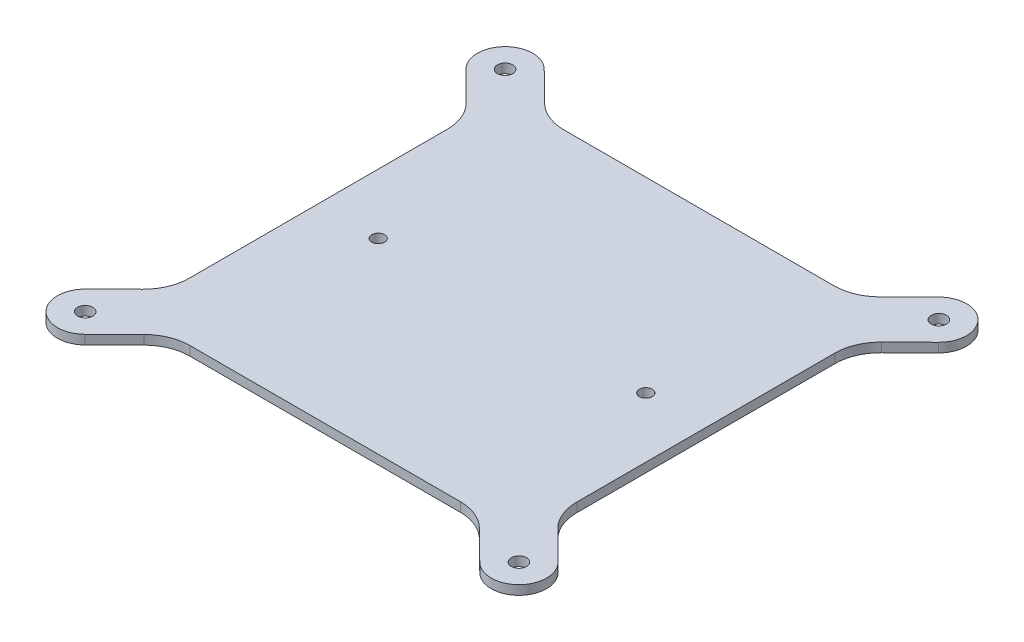
ISO-10303-21;
HEADER;
FILE_DESCRIPTION(('STEP AP214'),'2;1');
FILE_NAME('part.step','',(''),(''),'','','');
FILE_SCHEMA(('AUTOMOTIVE_DESIGN { 1 0 10303 214 1 1 1 1 }'));
ENDSEC;
DATA;
#1=APPLICATION_CONTEXT('core data for automotive mechanical design processes');
#2=APPLICATION_PROTOCOL_DEFINITION('international standard','automotive_design',2000,#1);
#3=PRODUCT_CONTEXT('',#1,'mechanical');
#4=PRODUCT('Part','Part','',(#3));
#5=PRODUCT_RELATED_PRODUCT_CATEGORY('part','',(#4));
#6=PRODUCT_DEFINITION_FORMATION('','',#4);
#7=PRODUCT_DEFINITION_CONTEXT('part definition',#1,'design');
#8=PRODUCT_DEFINITION('design','',#6,#7);
#9=PRODUCT_DEFINITION_SHAPE('','',#8);
#10=(LENGTH_UNIT() NAMED_UNIT(*) SI_UNIT(.MILLI.,.METRE.));
#11=(NAMED_UNIT(*) PLANE_ANGLE_UNIT() SI_UNIT($,.RADIAN.));
#12=(NAMED_UNIT(*) SI_UNIT($,.STERADIAN.) SOLID_ANGLE_UNIT());
#13=UNCERTAINTY_MEASURE_WITH_UNIT(LENGTH_MEASURE(1.E-05),#10,'distance_accuracy_value','');
#14=(GEOMETRIC_REPRESENTATION_CONTEXT(3) GLOBAL_UNCERTAINTY_ASSIGNED_CONTEXT((#13)) GLOBAL_UNIT_ASSIGNED_CONTEXT((#10,
#11,#12)) REPRESENTATION_CONTEXT('',''));
#15=CARTESIAN_POINT('',(0.,0.,0.));
#16=DIRECTION('',(0.,0.,1.));
#17=DIRECTION('',(1.,0.,0.));
#18=AXIS2_PLACEMENT_3D('',#15,#16,#17);
#19=CARTESIAN_POINT('',(42.,2.,40.5));
#20=DIRECTION('',(-1.,0.,0.));
#21=DIRECTION('',(0.,0.,1.));
#22=AXIS2_PLACEMENT_3D('',#19,#20,#21);
#23=PLANE('',#22);
#24=DIRECTION('',(0.,0.,-1.));
#25=VECTOR('',#24,1.);
#26=CARTESIAN_POINT('',(42.,2.,40.5));
#27=LINE('',#26,#25);
#28=CARTESIAN_POINT('',(42.,2.,27.9432522277284));
#29=VERTEX_POINT('',#28);
#30=CARTESIAN_POINT('',(42.,2.,-27.9432522277284));
#31=VERTEX_POINT('',#30);
#32=EDGE_CURVE('E310',#29,#31,#27,.T.);
#33=ORIENTED_EDGE('',*,*,#32,.F.);
#34=DIRECTION('',(0.,-1.,0.));
#35=VECTOR('',#34,1.);
#36=CARTESIAN_POINT('',(42.,2.,27.9432522277284));
#37=LINE('',#36,#35);
#38=CARTESIAN_POINT('',(42.,0.,27.9432522277284));
#39=VERTEX_POINT('',#38);
#40=EDGE_CURVE('E352',#29,#39,#37,.T.);
#41=ORIENTED_EDGE('',*,*,#40,.T.);
#42=DIRECTION('',(0.,0.,-1.));
#43=VECTOR('',#42,1.);
#44=CARTESIAN_POINT('',(42.,0.,40.5));
#45=LINE('',#44,#43);
#46=CARTESIAN_POINT('',(42.,0.,-27.9432522277284));
#47=VERTEX_POINT('',#46);
#48=EDGE_CURVE('E309',#39,#47,#45,.T.);
#49=ORIENTED_EDGE('',*,*,#48,.T.);
#50=DIRECTION('',(0.,-1.,0.));
#51=VECTOR('',#50,1.);
#52=CARTESIAN_POINT('',(42.,2.,-27.9432522277284));
#53=LINE('',#52,#51);
#54=EDGE_CURVE('E350',#47,#31,#53,.F.);
#55=ORIENTED_EDGE('',*,*,#54,.T.);
#56=EDGE_LOOP('',(#33,#41,#49,#55));
#57=FACE_BOUND('',#56,.T.);
#58=ADVANCED_FACE('F32',(#57),#23,.F.);
#59=CARTESIAN_POINT('',(42.,2.,-40.5));
#60=DIRECTION('',(0.,0.,1.));
#61=DIRECTION('',(1.,0.,0.));
#62=AXIS2_PLACEMENT_3D('',#59,#60,#61);
#63=PLANE('',#62);
#64=DIRECTION('',(-1.,0.,0.));
#65=VECTOR('',#64,1.);
#66=CARTESIAN_POINT('',(42.,2.,-40.5));
#67=LINE('',#66,#65);
#68=CARTESIAN_POINT('',(29.3003815198264,2.,-40.5));
#69=VERTEX_POINT('',#68);
#70=CARTESIAN_POINT('',(-29.3003815198264,2.,-40.5));
#71=VERTEX_POINT('',#70);
#72=EDGE_CURVE('E313',#69,#71,#67,.T.);
#73=ORIENTED_EDGE('',*,*,#72,.F.);
#74=DIRECTION('',(0.,1.,0.));
#75=VECTOR('',#74,1.);
#76=CARTESIAN_POINT('',(29.3003815198264,0.,-40.5));
#77=LINE('',#76,#75);
#78=CARTESIAN_POINT('',(29.3003815198264,0.,-40.5));
#79=VERTEX_POINT('',#78);
#80=EDGE_CURVE('E365',#69,#79,#77,.F.);
#81=ORIENTED_EDGE('',*,*,#80,.T.);
#82=DIRECTION('',(-1.,0.,0.));
#83=VECTOR('',#82,1.);
#84=CARTESIAN_POINT('',(42.,0.,-40.5));
#85=LINE('',#84,#83);
#86=CARTESIAN_POINT('',(-29.3003815198264,0.,-40.5));
#87=VERTEX_POINT('',#86);
#88=EDGE_CURVE('E325',#79,#87,#85,.T.);
#89=ORIENTED_EDGE('',*,*,#88,.T.);
#90=DIRECTION('',(0.,1.,0.));
#91=VECTOR('',#90,1.);
#92=CARTESIAN_POINT('',(-29.3003815198264,2.,-40.5));
#93=LINE('',#92,#91);
#94=EDGE_CURVE('E362',#87,#71,#93,.T.);
#95=ORIENTED_EDGE('',*,*,#94,.T.);
#96=EDGE_LOOP('',(#73,#81,#89,#95));
#97=FACE_BOUND('',#96,.T.);
#98=ADVANCED_FACE('F430',(#97),#63,.F.);
#99=CARTESIAN_POINT('',(-42.,2.,40.5));
#100=DIRECTION('',(1.,0.,0.));
#101=DIRECTION('',(0.,0.,-1.));
#102=AXIS2_PLACEMENT_3D('',#99,#100,#101);
#103=PLANE('',#102);
#104=DIRECTION('',(0.,0.,1.));
#105=VECTOR('',#104,1.);
#106=CARTESIAN_POINT('',(-42.,0.,40.5));
#107=LINE('',#106,#105);
#108=CARTESIAN_POINT('',(-42.,0.,-27.9432522277284));
#109=VERTEX_POINT('',#108);
#110=CARTESIAN_POINT('',(-42.,0.,27.9432522277284));
#111=VERTEX_POINT('',#110);
#112=EDGE_CURVE('E328',#109,#111,#107,.T.);
#113=ORIENTED_EDGE('',*,*,#112,.T.);
#114=DIRECTION('',(0.,-1.,0.));
#115=VECTOR('',#114,1.);
#116=CARTESIAN_POINT('',(-42.,2.,27.9432522277284));
#117=LINE('',#116,#115);
#118=CARTESIAN_POINT('',(-42.,2.,27.9432522277284));
#119=VERTEX_POINT('',#118);
#120=EDGE_CURVE('E338',#111,#119,#117,.F.);
#121=ORIENTED_EDGE('',*,*,#120,.T.);
#122=DIRECTION('',(0.,0.,1.));
#123=VECTOR('',#122,1.);
#124=CARTESIAN_POINT('',(-42.,2.,40.5));
#125=LINE('',#124,#123);
#126=CARTESIAN_POINT('',(-42.,2.,-27.9432522277284));
#127=VERTEX_POINT('',#126);
#128=EDGE_CURVE('E316',#127,#119,#125,.T.);
#129=ORIENTED_EDGE('',*,*,#128,.F.);
#130=DIRECTION('',(0.,-1.,0.));
#131=VECTOR('',#130,1.);
#132=CARTESIAN_POINT('',(-42.,2.,-27.9432522277284));
#133=LINE('',#132,#131);
#134=EDGE_CURVE('E335',#127,#109,#133,.T.);
#135=ORIENTED_EDGE('',*,*,#134,.T.);
#136=EDGE_LOOP('',(#113,#121,#129,#135));
#137=FACE_BOUND('',#136,.T.);
#138=ADVANCED_FACE('F405',(#137),#103,.F.);
#139=CARTESIAN_POINT('',(42.,2.,40.5));
#140=DIRECTION('',(0.,0.,-1.));
#141=DIRECTION('',(-1.,0.,0.));
#142=AXIS2_PLACEMENT_3D('',#139,#140,#141);
#143=PLANE('',#142);
#144=DIRECTION('',(1.,0.,0.));
#145=VECTOR('',#144,1.);
#146=CARTESIAN_POINT('',(42.,2.,40.5));
#147=LINE('',#146,#145);
#148=CARTESIAN_POINT('',(-29.3003815198264,2.,40.5));
#149=VERTEX_POINT('',#148);
#150=CARTESIAN_POINT('',(29.3003815198264,2.,40.5));
#151=VERTEX_POINT('',#150);
#152=EDGE_CURVE('E319',#149,#151,#147,.T.);
#153=ORIENTED_EDGE('',*,*,#152,.F.);
#154=DIRECTION('',(0.,1.,0.));
#155=VECTOR('',#154,1.);
#156=CARTESIAN_POINT('',(-29.3003815198264,0.,40.5));
#157=LINE('',#156,#155);
#158=CARTESIAN_POINT('',(-29.3003815198264,0.,40.5));
#159=VERTEX_POINT('',#158);
#160=EDGE_CURVE('E346',#149,#159,#157,.F.);
#161=ORIENTED_EDGE('',*,*,#160,.T.);
#162=DIRECTION('',(1.,0.,0.));
#163=VECTOR('',#162,1.);
#164=CARTESIAN_POINT('',(42.,0.,40.5));
#165=LINE('',#164,#163);
#166=CARTESIAN_POINT('',(29.3003815198264,0.,40.5));
#167=VERTEX_POINT('',#166);
#168=EDGE_CURVE('E314',#159,#167,#165,.T.);
#169=ORIENTED_EDGE('',*,*,#168,.T.);
#170=DIRECTION('',(0.,1.,0.));
#171=VECTOR('',#170,1.);
#172=CARTESIAN_POINT('',(29.3003815198264,2.,40.5));
#173=LINE('',#172,#171);
#174=EDGE_CURVE('E343',#167,#151,#173,.T.);
#175=ORIENTED_EDGE('',*,*,#174,.T.);
#176=EDGE_LOOP('',(#153,#161,#169,#175));
#177=FACE_BOUND('',#176,.T.);
#178=ADVANCED_FACE('F474',(#177),#143,.F.);
#179=CARTESIAN_POINT('',(0.,2.,0.));
#180=DIRECTION('',(0.,1.,0.));
#181=DIRECTION('',(0.,0.,1.));
#182=AXIS2_PLACEMENT_3D('',#179,#180,#181);
#183=PLANE('',#182);
#184=CARTESIAN_POINT('',(-29.,2.,0.));
#185=DIRECTION('',(0.,1.,0.));
#186=DIRECTION('',(0.,0.,1.));
#187=AXIS2_PLACEMENT_3D('',#184,#185,#186);
#188=CIRCLE('',#187,1.4);
#189=CARTESIAN_POINT('',(-29.,2.,1.4));
#190=VERTEX_POINT('',#189);
#191=EDGE_CURVE('E574',#190,#190,#188,.T.);
#192=ORIENTED_EDGE('',*,*,#191,.F.);
#193=EDGE_LOOP('',(#192));
#194=FACE_BOUND('',#193,.T.);
#195=CARTESIAN_POINT('',(29.,2.,0.));
#196=DIRECTION('',(0.,1.,0.));
#197=DIRECTION('',(0.,0.,1.));
#198=AXIS2_PLACEMENT_3D('',#195,#196,#197);
#199=CIRCLE('',#198,1.4);
#200=CARTESIAN_POINT('',(29.,2.,1.4));
#201=VERTEX_POINT('',#200);
#202=EDGE_CURVE('E461',#201,#201,#199,.T.);
#203=ORIENTED_EDGE('',*,*,#202,.F.);
#204=EDGE_LOOP('',(#203));
#205=FACE_BOUND('',#204,.T.);
#206=DIRECTION('',(-0.711095379397229,0.,-0.703095556379011));
#207=VECTOR('',#206,1.);
#208=CARTESIAN_POINT('',(51.2185733382741,2.,41.2334277236166));
#209=LINE('',#208,#207);
#210=CARTESIAN_POINT('',(51.2185733382741,2.,41.2334277236166));
#211=VERTEX_POINT('',#210);
#212=CARTESIAN_POINT('',(44.9690444362099,2.,35.0542060217007));
#213=VERTEX_POINT('',#212);
#214=EDGE_CURVE('E206',#211,#213,#209,.T.);
#215=ORIENTED_EDGE('',*,*,#214,.T.);
#216=CARTESIAN_POINT('',(52.,2.,27.9432522277284));
#217=DIRECTION('',(0.,1.,0.));
#218=DIRECTION('',(0.,0.,1.));
#219=AXIS2_PLACEMENT_3D('',#216,#217,#218);
#220=CIRCLE('',#219,10.);
#221=EDGE_CURVE('E384',#213,#29,#220,.F.);
#222=ORIENTED_EDGE('',*,*,#221,.T.);
#223=ORIENTED_EDGE('',*,*,#32,.T.);
#224=CARTESIAN_POINT('',(52.,2.,-27.9432522277284));
#225=DIRECTION('',(0.,1.,0.));
#226=DIRECTION('',(0.,0.,1.));
#227=AXIS2_PLACEMENT_3D('',#224,#225,#226);
#228=CIRCLE('',#227,10.);
#229=CARTESIAN_POINT('',(44.9690444362099,2.,-35.0542060217007));
#230=VERTEX_POINT('',#229);
#231=EDGE_CURVE('E388',#31,#230,#228,.F.);
#232=ORIENTED_EDGE('',*,*,#231,.T.);
#233=DIRECTION('',(-0.711095379397229,0.,0.703095556379011));
#234=VECTOR('',#233,1.);
#235=CARTESIAN_POINT('',(51.2185733382741,2.,-41.2334277236166));
#236=LINE('',#235,#234);
#237=CARTESIAN_POINT('',(51.2185733382741,2.,-41.2334277236166));
#238=VERTEX_POINT('',#237);
#239=EDGE_CURVE('E231',#238,#230,#236,.T.);
#240=ORIENTED_EDGE('',*,*,#239,.F.);
#241=CARTESIAN_POINT('',(47.,2.,-45.5));
#242=DIRECTION('',(0.,-1.,0.));
#243=DIRECTION('',(0.,0.,1.));
#244=AXIS2_PLACEMENT_3D('',#241,#242,#243);
#245=CIRCLE('',#244,6.);
#246=CARTESIAN_POINT('',(42.7814266617259,2.,-49.7665722763834));
#247=VERTEX_POINT('',#246);
#248=EDGE_CURVE('E239',#247,#238,#245,.T.);
#249=ORIENTED_EDGE('',*,*,#248,.F.);
#250=DIRECTION('',(0.711095379397228,0.,-0.703095556379011));
#251=VECTOR('',#250,1.);
#252=CARTESIAN_POINT('',(42.7814266617259,2.,-49.7665722763834));
#253=LINE('',#252,#251);
#254=CARTESIAN_POINT('',(36.3313370836165,2.,-43.3890462060277));
#255=VERTEX_POINT('',#254);
#256=EDGE_CURVE('E236',#255,#247,#253,.T.);
#257=ORIENTED_EDGE('',*,*,#256,.F.);
#258=CARTESIAN_POINT('',(29.3003815198264,2.,-50.5));
#259=DIRECTION('',(0.,1.,0.));
#260=DIRECTION('',(0.,0.,1.));
#261=AXIS2_PLACEMENT_3D('',#258,#259,#260);
#262=CIRCLE('',#261,10.);
#263=EDGE_CURVE('E390',#255,#69,#262,.F.);
#264=ORIENTED_EDGE('',*,*,#263,.T.);
#265=ORIENTED_EDGE('',*,*,#72,.T.);
#266=CARTESIAN_POINT('',(-29.3003815198264,2.,-50.5));
#267=DIRECTION('',(0.,1.,0.));
#268=DIRECTION('',(0.,0.,1.));
#269=AXIS2_PLACEMENT_3D('',#266,#267,#268);
#270=CIRCLE('',#269,10.);
#271=CARTESIAN_POINT('',(-36.3313370836165,2.,-43.3890462060277));
#272=VERTEX_POINT('',#271);
#273=EDGE_CURVE('E40',#71,#272,#270,.F.);
#274=ORIENTED_EDGE('',*,*,#273,.T.);
#275=DIRECTION('',(-0.711095379397228,0.,-0.703095556379011));
#276=VECTOR('',#275,1.);
#277=CARTESIAN_POINT('',(-42.7814266617259,2.,-49.7665722763834));
#278=LINE('',#277,#276);
#279=CARTESIAN_POINT('',(-42.7814266617259,2.,-49.7665722763834));
#280=VERTEX_POINT('',#279);
#281=EDGE_CURVE('E301',#272,#280,#278,.T.);
#282=ORIENTED_EDGE('',*,*,#281,.T.);
#283=CARTESIAN_POINT('',(-47.,2.,-45.5));
#284=DIRECTION('',(0.,1.,0.));
#285=DIRECTION('',(0.,0.,1.));
#286=AXIS2_PLACEMENT_3D('',#283,#284,#285);
#287=CIRCLE('',#286,6.);
#288=CARTESIAN_POINT('',(-51.2185733382741,2.,-41.2334277236166));
#289=VERTEX_POINT('',#288);
#290=EDGE_CURVE('E295',#280,#289,#287,.T.);
#291=ORIENTED_EDGE('',*,*,#290,.T.);
#292=DIRECTION('',(0.711095379397229,0.,0.703095556379011));
#293=VECTOR('',#292,1.);
#294=CARTESIAN_POINT('',(-51.2185733382741,2.,-41.2334277236166));
#295=LINE('',#294,#293);
#296=CARTESIAN_POINT('',(-44.9690444362099,2.,-35.0542060217007));
#297=VERTEX_POINT('',#296);
#298=EDGE_CURVE('E298',#289,#297,#295,.T.);
#299=ORIENTED_EDGE('',*,*,#298,.T.);
#300=CARTESIAN_POINT('',(-52.,2.,-27.9432522277284));
#301=DIRECTION('',(0.,1.,0.));
#302=DIRECTION('',(0.,0.,1.));
#303=AXIS2_PLACEMENT_3D('',#300,#301,#302);
#304=CIRCLE('',#303,10.);
#305=EDGE_CURVE('E396',#297,#127,#304,.F.);
#306=ORIENTED_EDGE('',*,*,#305,.T.);
#307=ORIENTED_EDGE('',*,*,#128,.T.);
#308=CARTESIAN_POINT('',(-52.,2.,27.9432522277284));
#309=DIRECTION('',(0.,1.,0.));
#310=DIRECTION('',(0.,0.,1.));
#311=AXIS2_PLACEMENT_3D('',#308,#309,#310);
#312=CIRCLE('',#311,10.);
#313=CARTESIAN_POINT('',(-44.9690444362099,2.,35.0542060217007));
#314=VERTEX_POINT('',#313);
#315=EDGE_CURVE('E372',#119,#314,#312,.F.);
#316=ORIENTED_EDGE('',*,*,#315,.T.);
#317=DIRECTION('',(0.711095379397229,0.,-0.703095556379011));
#318=VECTOR('',#317,1.);
#319=CARTESIAN_POINT('',(-51.2185733382741,2.,41.2334277236166));
#320=LINE('',#319,#318);
#321=CARTESIAN_POINT('',(-51.2185733382741,2.,41.2334277236166));
#322=VERTEX_POINT('',#321);
#323=EDGE_CURVE('E258',#322,#314,#320,.T.);
#324=ORIENTED_EDGE('',*,*,#323,.F.);
#325=CARTESIAN_POINT('',(-47.,2.,45.5));
#326=DIRECTION('',(0.,-1.,0.));
#327=DIRECTION('',(0.,0.,-1.));
#328=AXIS2_PLACEMENT_3D('',#325,#326,#327);
#329=CIRCLE('',#328,6.);
#330=CARTESIAN_POINT('',(-42.7814266617259,2.,49.7665722763834));
#331=VERTEX_POINT('',#330);
#332=EDGE_CURVE('E266',#331,#322,#329,.T.);
#333=ORIENTED_EDGE('',*,*,#332,.F.);
#334=DIRECTION('',(-0.711095379397228,0.,0.703095556379011));
#335=VECTOR('',#334,1.);
#336=CARTESIAN_POINT('',(-42.7814266617259,2.,49.7665722763834));
#337=LINE('',#336,#335);
#338=CARTESIAN_POINT('',(-36.3313370836166,2.,43.3890462060277));
#339=VERTEX_POINT('',#338);
#340=EDGE_CURVE('E263',#339,#331,#337,.T.);
#341=ORIENTED_EDGE('',*,*,#340,.F.);
#342=CARTESIAN_POINT('',(-29.3003815198264,2.,50.5));
#343=DIRECTION('',(0.,1.,0.));
#344=DIRECTION('',(0.,0.,1.));
#345=AXIS2_PLACEMENT_3D('',#342,#343,#344);
#346=CIRCLE('',#345,10.);
#347=EDGE_CURVE('E374',#339,#149,#346,.F.);
#348=ORIENTED_EDGE('',*,*,#347,.T.);
#349=ORIENTED_EDGE('',*,*,#152,.T.);
#350=CARTESIAN_POINT('',(29.3003815198264,2.,50.5));
#351=DIRECTION('',(0.,1.,0.));
#352=DIRECTION('',(0.,0.,1.));
#353=AXIS2_PLACEMENT_3D('',#350,#351,#352);
#354=CIRCLE('',#353,10.);
#355=CARTESIAN_POINT('',(36.3313370836166,2.,43.3890462060277));
#356=VERTEX_POINT('',#355);
#357=EDGE_CURVE('E378',#151,#356,#354,.F.);
#358=ORIENTED_EDGE('',*,*,#357,.T.);
#359=DIRECTION('',(0.711095379397228,0.,0.703095556379011));
#360=VECTOR('',#359,1.);
#361=CARTESIAN_POINT('',(42.7814266617259,2.,49.7665722763834));
#362=LINE('',#361,#360);
#363=CARTESIAN_POINT('',(42.7814266617259,2.,49.7665722763834));
#364=VERTEX_POINT('',#363);
#365=EDGE_CURVE('E203',#356,#364,#362,.T.);
#366=ORIENTED_EDGE('',*,*,#365,.T.);
#367=CARTESIAN_POINT('',(47.,2.,45.5));
#368=DIRECTION('',(0.,1.,0.));
#369=DIRECTION('',(0.,0.,-1.));
#370=AXIS2_PLACEMENT_3D('',#367,#368,#369);
#371=CIRCLE('',#370,6.);
#372=EDGE_CURVE('E198',#364,#211,#371,.T.);
#373=ORIENTED_EDGE('',*,*,#372,.T.);
#374=EDGE_LOOP('',(#215,#222,#223,#232,#240,#249,#257,#264,#265,#274,#282,#291,#299,#306,#307,
#316,#324,#333,#341,#348,#349,#358,#366,#373));
#375=FACE_BOUND('',#374,.T.);
#376=CARTESIAN_POINT('',(-47.,2.,-45.5));
#377=DIRECTION('',(0.,1.,0.));
#378=DIRECTION('',(0.,0.,1.));
#379=AXIS2_PLACEMENT_3D('',#376,#377,#378);
#380=CIRCLE('',#379,1.65);
#381=CARTESIAN_POINT('',(-47.,2.,-43.85));
#382=VERTEX_POINT('',#381);
#383=EDGE_CURVE('E284',#382,#382,#380,.T.);
#384=ORIENTED_EDGE('',*,*,#383,.F.);
#385=EDGE_LOOP('',(#384));
#386=FACE_BOUND('',#385,.T.);
#387=CARTESIAN_POINT('',(-47.,2.,45.5));
#388=DIRECTION('',(0.,-1.,0.));
#389=DIRECTION('',(0.,0.,-1.));
#390=AXIS2_PLACEMENT_3D('',#387,#388,#389);
#391=CIRCLE('',#390,1.65);
#392=CARTESIAN_POINT('',(-47.,2.,43.85));
#393=VERTEX_POINT('',#392);
#394=EDGE_CURVE('E257',#393,#393,#391,.T.);
#395=ORIENTED_EDGE('',*,*,#394,.T.);
#396=EDGE_LOOP('',(#395));
#397=FACE_BOUND('',#396,.T.);
#398=CARTESIAN_POINT('',(47.,2.,-45.5));
#399=DIRECTION('',(0.,-1.,0.));
#400=DIRECTION('',(0.,0.,1.));
#401=AXIS2_PLACEMENT_3D('',#398,#399,#400);
#402=CIRCLE('',#401,1.65);
#403=CARTESIAN_POINT('',(47.,2.,-43.85));
#404=VERTEX_POINT('',#403);
#405=EDGE_CURVE('E229',#404,#404,#402,.T.);
#406=ORIENTED_EDGE('',*,*,#405,.T.);
#407=EDGE_LOOP('',(#406));
#408=FACE_BOUND('',#407,.T.);
#409=CARTESIAN_POINT('',(47.,2.,45.5));
#410=DIRECTION('',(0.,1.,0.));
#411=DIRECTION('',(0.,0.,-1.));
#412=AXIS2_PLACEMENT_3D('',#409,#410,#411);
#413=CIRCLE('',#412,1.65);
#414=CARTESIAN_POINT('',(47.,2.,43.85));
#415=VERTEX_POINT('',#414);
#416=EDGE_CURVE('E216',#415,#415,#413,.T.);
#417=ORIENTED_EDGE('',*,*,#416,.F.);
#418=EDGE_LOOP('',(#417));
#419=FACE_BOUND('',#418,.T.);
#420=ADVANCED_FACE('F212',(#194,#205,#375,#386,#397,#408,#419),#183,.T.);
#421=CARTESIAN_POINT('',(0.,0.,0.));
#422=DIRECTION('',(0.,1.,0.));
#423=DIRECTION('',(0.,0.,1.));
#424=AXIS2_PLACEMENT_3D('',#421,#422,#423);
#425=PLANE('',#424);
#426=CARTESIAN_POINT('',(-29.,0.,0.));
#427=DIRECTION('',(0.,1.,0.));
#428=DIRECTION('',(0.,0.,1.));
#429=AXIS2_PLACEMENT_3D('',#426,#427,#428);
#430=CIRCLE('',#429,1.4);
#431=CARTESIAN_POINT('',(-29.,0.,1.4));
#432=VERTEX_POINT('',#431);
#433=EDGE_CURVE('E219',#432,#432,#430,.T.);
#434=ORIENTED_EDGE('',*,*,#433,.T.);
#435=EDGE_LOOP('',(#434));
#436=FACE_BOUND('',#435,.T.);
#437=CARTESIAN_POINT('',(29.,0.,0.));
#438=DIRECTION('',(0.,1.,0.));
#439=DIRECTION('',(0.,0.,1.));
#440=AXIS2_PLACEMENT_3D('',#437,#438,#439);
#441=CIRCLE('',#440,1.4);
#442=CARTESIAN_POINT('',(29.,0.,1.4));
#443=VERTEX_POINT('',#442);
#444=EDGE_CURVE('E575',#443,#443,#441,.T.);
#445=ORIENTED_EDGE('',*,*,#444,.T.);
#446=EDGE_LOOP('',(#445));
#447=FACE_BOUND('',#446,.T.);
#448=ORIENTED_EDGE('',*,*,#48,.F.);
#449=CARTESIAN_POINT('',(52.,0.,27.9432522277284));
#450=DIRECTION('',(0.,1.,0.));
#451=DIRECTION('',(0.,0.,1.));
#452=AXIS2_PLACEMENT_3D('',#449,#450,#451);
#453=CIRCLE('',#452,10.);
#454=CARTESIAN_POINT('',(44.9690444362099,0.,35.0542060217007));
#455=VERTEX_POINT('',#454);
#456=EDGE_CURVE('E382',#39,#455,#453,.T.);
#457=ORIENTED_EDGE('',*,*,#456,.T.);
#458=DIRECTION('',(0.711095379397229,0.,0.703095556379011));
#459=VECTOR('',#458,1.);
#460=CARTESIAN_POINT('',(51.2185733382741,0.,41.2334277236166));
#461=LINE('',#460,#459);
#462=CARTESIAN_POINT('',(51.2185733382741,0.,41.2334277236166));
#463=VERTEX_POINT('',#462);
#464=EDGE_CURVE('E230',#455,#463,#461,.T.);
#465=ORIENTED_EDGE('',*,*,#464,.T.);
#466=CARTESIAN_POINT('',(47.,0.,45.5));
#467=DIRECTION('',(0.,1.,0.));
#468=DIRECTION('',(0.,0.,1.));
#469=AXIS2_PLACEMENT_3D('',#466,#467,#468);
#470=CIRCLE('',#469,6.);
#471=CARTESIAN_POINT('',(42.7814266617259,0.,49.7665722763834));
#472=VERTEX_POINT('',#471);
#473=EDGE_CURVE('E199',#463,#472,#470,.F.);
#474=ORIENTED_EDGE('',*,*,#473,.T.);
#475=DIRECTION('',(-0.711095379397229,0.,-0.703095556379012));
#476=VECTOR('',#475,1.);
#477=CARTESIAN_POINT('',(42.7814266617259,0.,49.7665722763834));
#478=LINE('',#477,#476);
#479=CARTESIAN_POINT('',(36.3313370836165,0.,43.3890462060277));
#480=VERTEX_POINT('',#479);
#481=EDGE_CURVE('E224',#472,#480,#478,.T.);
#482=ORIENTED_EDGE('',*,*,#481,.T.);
#483=CARTESIAN_POINT('',(29.3003815198264,0.,50.5));
#484=DIRECTION('',(0.,1.,0.));
#485=DIRECTION('',(0.,0.,1.));
#486=AXIS2_PLACEMENT_3D('',#483,#484,#485);
#487=CIRCLE('',#486,10.);
#488=EDGE_CURVE('E380',#480,#167,#487,.T.);
#489=ORIENTED_EDGE('',*,*,#488,.T.);
#490=ORIENTED_EDGE('',*,*,#168,.F.);
#491=CARTESIAN_POINT('',(-29.3003815198264,0.,50.5));
#492=DIRECTION('',(0.,1.,0.));
#493=DIRECTION('',(0.,0.,1.));
#494=AXIS2_PLACEMENT_3D('',#491,#492,#493);
#495=CIRCLE('',#494,10.);
#496=CARTESIAN_POINT('',(-36.3313370836166,0.,43.3890462060277));
#497=VERTEX_POINT('',#496);
#498=EDGE_CURVE('E376',#159,#497,#495,.T.);
#499=ORIENTED_EDGE('',*,*,#498,.T.);
#500=DIRECTION('',(0.711095379397229,0.,-0.703095556379012));
#501=VECTOR('',#500,1.);
#502=CARTESIAN_POINT('',(-42.7814266617259,0.,49.7665722763834));
#503=LINE('',#502,#501);
#504=CARTESIAN_POINT('',(-42.7814266617259,0.,49.7665722763834));
#505=VERTEX_POINT('',#504);
#506=EDGE_CURVE('E261',#505,#497,#503,.T.);
#507=ORIENTED_EDGE('',*,*,#506,.F.);
#508=CARTESIAN_POINT('',(-47.,0.,45.5));
#509=DIRECTION('',(0.,1.,0.));
#510=DIRECTION('',(0.,0.,1.));
#511=AXIS2_PLACEMENT_3D('',#508,#509,#510);
#512=CIRCLE('',#511,6.);
#513=CARTESIAN_POINT('',(-51.2185733382741,0.,41.2334277236166));
#514=VERTEX_POINT('',#513);
#515=EDGE_CURVE('E273',#514,#505,#512,.T.);
#516=ORIENTED_EDGE('',*,*,#515,.F.);
#517=DIRECTION('',(-0.711095379397229,0.,0.703095556379011));
#518=VECTOR('',#517,1.);
#519=CARTESIAN_POINT('',(-51.2185733382741,0.,41.2334277236166));
#520=LINE('',#519,#518);
#521=CARTESIAN_POINT('',(-44.9690444362099,0.,35.0542060217007));
#522=VERTEX_POINT('',#521);
#523=EDGE_CURVE('E269',#522,#514,#520,.T.);
#524=ORIENTED_EDGE('',*,*,#523,.F.);
#525=CARTESIAN_POINT('',(-52.,0.,27.9432522277284));
#526=DIRECTION('',(0.,1.,0.));
#527=DIRECTION('',(0.,0.,1.));
#528=AXIS2_PLACEMENT_3D('',#525,#526,#527);
#529=CIRCLE('',#528,10.);
#530=EDGE_CURVE('E370',#522,#111,#529,.T.);
#531=ORIENTED_EDGE('',*,*,#530,.T.);
#532=ORIENTED_EDGE('',*,*,#112,.F.);
#533=CARTESIAN_POINT('',(-52.,0.,-27.9432522277284));
#534=DIRECTION('',(0.,1.,0.));
#535=DIRECTION('',(0.,0.,1.));
#536=AXIS2_PLACEMENT_3D('',#533,#534,#535);
#537=CIRCLE('',#536,10.);
#538=CARTESIAN_POINT('',(-44.9690444362099,0.,-35.0542060217007));
#539=VERTEX_POINT('',#538);
#540=EDGE_CURVE('E394',#109,#539,#537,.T.);
#541=ORIENTED_EDGE('',*,*,#540,.T.);
#542=DIRECTION('',(-0.711095379397229,0.,-0.703095556379011));
#543=VECTOR('',#542,1.);
#544=CARTESIAN_POINT('',(-51.2185733382741,0.,-41.2334277236166));
#545=LINE('',#544,#543);
#546=CARTESIAN_POINT('',(-51.2185733382741,0.,-41.2334277236166));
#547=VERTEX_POINT('',#546);
#548=EDGE_CURVE('E285',#539,#547,#545,.T.);
#549=ORIENTED_EDGE('',*,*,#548,.T.);
#550=CARTESIAN_POINT('',(-47.,0.,-45.5));
#551=DIRECTION('',(0.,1.,0.));
#552=DIRECTION('',(0.,0.,1.));
#553=AXIS2_PLACEMENT_3D('',#550,#551,#552);
#554=CIRCLE('',#553,6.);
#555=CARTESIAN_POINT('',(-42.7814266617259,0.,-49.7665722763834));
#556=VERTEX_POINT('',#555);
#557=EDGE_CURVE('E288',#547,#556,#554,.F.);
#558=ORIENTED_EDGE('',*,*,#557,.T.);
#559=DIRECTION('',(0.711095379397229,0.,0.703095556379012));
#560=VECTOR('',#559,1.);
#561=CARTESIAN_POINT('',(-42.7814266617259,0.,-49.7665722763834));
#562=LINE('',#561,#560);
#563=CARTESIAN_POINT('',(-36.3313370836165,0.,-43.3890462060277));
#564=VERTEX_POINT('',#563);
#565=EDGE_CURVE('E289',#556,#564,#562,.T.);
#566=ORIENTED_EDGE('',*,*,#565,.T.);
#567=CARTESIAN_POINT('',(-29.3003815198264,0.,-50.5));
#568=DIRECTION('',(0.,1.,0.));
#569=DIRECTION('',(0.,0.,1.));
#570=AXIS2_PLACEMENT_3D('',#567,#568,#569);
#571=CIRCLE('',#570,10.);
#572=EDGE_CURVE('E11',#564,#87,#571,.T.);
#573=ORIENTED_EDGE('',*,*,#572,.T.);
#574=ORIENTED_EDGE('',*,*,#88,.F.);
#575=CARTESIAN_POINT('',(29.3003815198264,0.,-50.5));
#576=DIRECTION('',(0.,1.,0.));
#577=DIRECTION('',(0.,0.,1.));
#578=AXIS2_PLACEMENT_3D('',#575,#576,#577);
#579=CIRCLE('',#578,10.);
#580=CARTESIAN_POINT('',(36.3313370836165,0.,-43.3890462060277));
#581=VERTEX_POINT('',#580);
#582=EDGE_CURVE('E392',#79,#581,#579,.T.);
#583=ORIENTED_EDGE('',*,*,#582,.T.);
#584=DIRECTION('',(-0.711095379397229,0.,0.703095556379012));
#585=VECTOR('',#584,1.);
#586=CARTESIAN_POINT('',(42.7814266617259,0.,-49.7665722763834));
#587=LINE('',#586,#585);
#588=CARTESIAN_POINT('',(42.7814266617259,0.,-49.7665722763834));
#589=VERTEX_POINT('',#588);
#590=EDGE_CURVE('E234',#589,#581,#587,.T.);
#591=ORIENTED_EDGE('',*,*,#590,.F.);
#592=CARTESIAN_POINT('',(47.,0.,-45.5));
#593=DIRECTION('',(0.,1.,0.));
#594=DIRECTION('',(0.,0.,1.));
#595=AXIS2_PLACEMENT_3D('',#592,#593,#594);
#596=CIRCLE('',#595,6.);
#597=CARTESIAN_POINT('',(51.2185733382741,0.,-41.2334277236166));
#598=VERTEX_POINT('',#597);
#599=EDGE_CURVE('E246',#598,#589,#596,.T.);
#600=ORIENTED_EDGE('',*,*,#599,.F.);
#601=DIRECTION('',(0.711095379397229,0.,-0.703095556379011));
#602=VECTOR('',#601,1.);
#603=CARTESIAN_POINT('',(51.2185733382741,0.,-41.2334277236166));
#604=LINE('',#603,#602);
#605=CARTESIAN_POINT('',(44.9690444362099,0.,-35.0542060217007));
#606=VERTEX_POINT('',#605);
#607=EDGE_CURVE('E242',#606,#598,#604,.T.);
#608=ORIENTED_EDGE('',*,*,#607,.F.);
#609=CARTESIAN_POINT('',(52.,0.,-27.9432522277284));
#610=DIRECTION('',(0.,1.,0.));
#611=DIRECTION('',(0.,0.,1.));
#612=AXIS2_PLACEMENT_3D('',#609,#610,#611);
#613=CIRCLE('',#612,10.);
#614=EDGE_CURVE('E386',#606,#47,#613,.T.);
#615=ORIENTED_EDGE('',*,*,#614,.T.);
#616=EDGE_LOOP('',(#448,#457,#465,#474,#482,#489,#490,#499,#507,#516,#524,#531,#532,#541,#549,
#558,#566,#573,#574,#583,#591,#600,#608,#615));
#617=FACE_BOUND('',#616,.T.);
#618=CARTESIAN_POINT('',(-47.,0.,45.5));
#619=DIRECTION('',(0.,1.,0.));
#620=DIRECTION('',(0.,0.,1.));
#621=AXIS2_PLACEMENT_3D('',#618,#619,#620);
#622=CIRCLE('',#621,1.65);
#623=CARTESIAN_POINT('',(-47.,0.,47.15));
#624=VERTEX_POINT('',#623);
#625=EDGE_CURVE('E265',#624,#624,#622,.T.);
#626=ORIENTED_EDGE('',*,*,#625,.T.);
#627=EDGE_LOOP('',(#626));
#628=FACE_BOUND('',#627,.T.);
#629=CARTESIAN_POINT('',(-47.,0.,-45.5));
#630=DIRECTION('',(0.,1.,0.));
#631=DIRECTION('',(0.,0.,1.));
#632=AXIS2_PLACEMENT_3D('',#629,#630,#631);
#633=CIRCLE('',#632,1.65);
#634=CARTESIAN_POINT('',(-47.,0.,-43.85));
#635=VERTEX_POINT('',#634);
#636=EDGE_CURVE('E287',#635,#635,#633,.F.);
#637=ORIENTED_EDGE('',*,*,#636,.F.);
#638=EDGE_LOOP('',(#637));
#639=FACE_BOUND('',#638,.T.);
#640=CARTESIAN_POINT('',(47.,0.,-45.5));
#641=DIRECTION('',(0.,1.,0.));
#642=DIRECTION('',(0.,0.,1.));
#643=AXIS2_PLACEMENT_3D('',#640,#641,#642);
#644=CIRCLE('',#643,1.65);
#645=CARTESIAN_POINT('',(47.,0.,-43.85));
#646=VERTEX_POINT('',#645);
#647=EDGE_CURVE('E238',#646,#646,#644,.T.);
#648=ORIENTED_EDGE('',*,*,#647,.T.);
#649=EDGE_LOOP('',(#648));
#650=FACE_BOUND('',#649,.T.);
#651=CARTESIAN_POINT('',(47.,0.,45.5));
#652=DIRECTION('',(0.,1.,0.));
#653=DIRECTION('',(0.,0.,1.));
#654=AXIS2_PLACEMENT_3D('',#651,#652,#653);
#655=CIRCLE('',#654,1.65);
#656=CARTESIAN_POINT('',(47.,0.,47.15));
#657=VERTEX_POINT('',#656);
#658=EDGE_CURVE('E226',#657,#657,#655,.F.);
#659=ORIENTED_EDGE('',*,*,#658,.F.);
#660=EDGE_LOOP('',(#659));
#661=FACE_BOUND('',#660,.T.);
#662=ADVANCED_FACE('F412',(#436,#447,#617,#628,#639,#650,#661),#425,.F.);
#663=CARTESIAN_POINT('',(-51.2185733382741,-31.0332508166644,-41.2334277236166));
#664=DIRECTION('',(-0.703095556379011,0.,0.711095379397229));
#665=DIRECTION('',(0.711095379397229,0.,0.703095556379011));
#666=AXIS2_PLACEMENT_3D('',#663,#664,#665);
#667=PLANE('',#666);
#668=ORIENTED_EDGE('',*,*,#548,.F.);
#669=DIRECTION('',(0.,-1.,0.));
#670=VECTOR('',#669,1.);
#671=CARTESIAN_POINT('',(-44.9690444362099,-31.0332508166644,-35.0542060217007));
#672=LINE('',#671,#670);
#673=EDGE_CURVE('E367',#539,#297,#672,.F.);
#674=ORIENTED_EDGE('',*,*,#673,.T.);
#675=ORIENTED_EDGE('',*,*,#298,.F.);
#676=DIRECTION('',(0.,1.,0.));
#677=VECTOR('',#676,1.);
#678=CARTESIAN_POINT('',(-51.2185733382741,-31.0332508166644,-41.2334277236166));
#679=LINE('',#678,#677);
#680=EDGE_CURVE('E303',#547,#289,#679,.T.);
#681=ORIENTED_EDGE('',*,*,#680,.F.);
#682=EDGE_LOOP('',(#668,#674,#675,#681));
#683=FACE_BOUND('',#682,.T.);
#684=ADVANCED_FACE('F417',(#683),#667,.T.);
#685=CARTESIAN_POINT('',(-42.7814266617259,-31.0332508166644,-49.7665722763834));
#686=DIRECTION('',(0.703095556379011,0.,-0.711095379397228));
#687=DIRECTION('',(-0.711095379397229,0.,-0.703095556379012));
#688=AXIS2_PLACEMENT_3D('',#685,#686,#687);
#689=PLANE('',#688);
#690=ORIENTED_EDGE('',*,*,#281,.F.);
#691=DIRECTION('',(0.,1.,0.));
#692=VECTOR('',#691,1.);
#693=CARTESIAN_POINT('',(-36.3313370836165,-31.0332508166644,-43.3890462060277));
#694=LINE('',#693,#692);
#695=EDGE_CURVE('E53',#272,#564,#694,.F.);
#696=ORIENTED_EDGE('',*,*,#695,.T.);
#697=ORIENTED_EDGE('',*,*,#565,.F.);
#698=DIRECTION('',(0.,1.,0.));
#699=VECTOR('',#698,1.);
#700=CARTESIAN_POINT('',(-42.7814266617259,-31.0332508166644,-49.7665722763834));
#701=LINE('',#700,#699);
#702=EDGE_CURVE('E291',#556,#280,#701,.T.);
#703=ORIENTED_EDGE('',*,*,#702,.T.);
#704=EDGE_LOOP('',(#690,#696,#697,#703));
#705=FACE_BOUND('',#704,.T.);
#706=ADVANCED_FACE('F423',(#705),#689,.T.);
#707=CARTESIAN_POINT('',(-47.,-31.0332508166644,-45.5));
#708=DIRECTION('',(0.,1.,0.));
#709=DIRECTION('',(0.,0.,1.));
#710=AXIS2_PLACEMENT_3D('',#707,#708,#709);
#711=CYLINDRICAL_SURFACE('',#710,6.);
#712=ORIENTED_EDGE('',*,*,#557,.F.);
#713=ORIENTED_EDGE('',*,*,#680,.T.);
#714=ORIENTED_EDGE('',*,*,#290,.F.);
#715=ORIENTED_EDGE('',*,*,#702,.F.);
#716=EDGE_LOOP('',(#712,#713,#714,#715));
#717=FACE_BOUND('',#716,.T.);
#718=ADVANCED_FACE('F420',(#717),#711,.T.);
#719=CARTESIAN_POINT('',(-47.,-31.0332508166644,-45.5));
#720=DIRECTION('',(0.,1.,0.));
#721=DIRECTION('',(0.,0.,1.));
#722=AXIS2_PLACEMENT_3D('',#719,#720,#721);
#723=CYLINDRICAL_SURFACE('',#722,1.65);
#724=ORIENTED_EDGE('',*,*,#636,.T.);
#725=EDGE_LOOP('',(#724));
#726=FACE_BOUND('',#725,.T.);
#727=ORIENTED_EDGE('',*,*,#383,.T.);
#728=EDGE_LOOP('',(#727));
#729=FACE_BOUND('',#728,.T.);
#730=ADVANCED_FACE('F525',(#726,#729),#723,.F.);
#731=CARTESIAN_POINT('',(-51.2185733382741,-31.0332508166644,41.2334277236166));
#732=DIRECTION('',(0.703095556379011,0.,0.711095379397229));
#733=DIRECTION('',(0.711095379397229,0.,-0.703095556379011));
#734=AXIS2_PLACEMENT_3D('',#731,#732,#733);
#735=PLANE('',#734);
#736=ORIENTED_EDGE('',*,*,#323,.T.);
#737=DIRECTION('',(0.,-1.,0.));
#738=VECTOR('',#737,1.);
#739=CARTESIAN_POINT('',(-44.9690444362099,0.,35.0542060217007));
#740=LINE('',#739,#738);
#741=EDGE_CURVE('E322',#314,#522,#740,.T.);
#742=ORIENTED_EDGE('',*,*,#741,.T.);
#743=ORIENTED_EDGE('',*,*,#523,.T.);
#744=DIRECTION('',(0.,1.,0.));
#745=VECTOR('',#744,1.);
#746=CARTESIAN_POINT('',(-51.2185733382741,-31.0332508166644,41.2334277236166));
#747=LINE('',#746,#745);
#748=EDGE_CURVE('E262',#514,#322,#747,.T.);
#749=ORIENTED_EDGE('',*,*,#748,.T.);
#750=EDGE_LOOP('',(#736,#742,#743,#749));
#751=FACE_BOUND('',#750,.T.);
#752=ADVANCED_FACE('F492',(#751),#735,.F.);
#753=CARTESIAN_POINT('',(-42.7814266617259,-31.0332508166644,49.7665722763834));
#754=DIRECTION('',(-0.703095556379011,0.,-0.711095379397228));
#755=DIRECTION('',(-0.711095379397229,0.,0.703095556379012));
#756=AXIS2_PLACEMENT_3D('',#753,#754,#755);
#757=PLANE('',#756);
#758=ORIENTED_EDGE('',*,*,#506,.T.);
#759=DIRECTION('',(0.,1.,0.));
#760=VECTOR('',#759,1.);
#761=CARTESIAN_POINT('',(-36.3313370836166,2.,43.3890462060277));
#762=LINE('',#761,#760);
#763=EDGE_CURVE('E340',#497,#339,#762,.T.);
#764=ORIENTED_EDGE('',*,*,#763,.T.);
#765=ORIENTED_EDGE('',*,*,#340,.T.);
#766=DIRECTION('',(0.,1.,0.));
#767=VECTOR('',#766,1.);
#768=CARTESIAN_POINT('',(-42.7814266617259,-31.0332508166644,49.7665722763834));
#769=LINE('',#768,#767);
#770=EDGE_CURVE('E270',#505,#331,#769,.T.);
#771=ORIENTED_EDGE('',*,*,#770,.F.);
#772=EDGE_LOOP('',(#758,#764,#765,#771));
#773=FACE_BOUND('',#772,.T.);
#774=ADVANCED_FACE('F483',(#773),#757,.F.);
#775=CARTESIAN_POINT('',(-47.,-31.0332508166644,45.5));
#776=DIRECTION('',(0.,1.,0.));
#777=DIRECTION('',(0.,0.,1.));
#778=AXIS2_PLACEMENT_3D('',#775,#776,#777);
#779=CYLINDRICAL_SURFACE('',#778,6.);
#780=ORIENTED_EDGE('',*,*,#748,.F.);
#781=ORIENTED_EDGE('',*,*,#515,.T.);
#782=ORIENTED_EDGE('',*,*,#770,.T.);
#783=ORIENTED_EDGE('',*,*,#332,.T.);
#784=EDGE_LOOP('',(#780,#781,#782,#783));
#785=FACE_BOUND('',#784,.T.);
#786=ADVANCED_FACE('F489',(#785),#779,.T.);
#787=CARTESIAN_POINT('',(-47.,-31.0332508166644,45.5));
#788=DIRECTION('',(0.,1.,0.));
#789=DIRECTION('',(0.,0.,1.));
#790=AXIS2_PLACEMENT_3D('',#787,#788,#789);
#791=CYLINDRICAL_SURFACE('',#790,1.65);
#792=ORIENTED_EDGE('',*,*,#625,.F.);
#793=EDGE_LOOP('',(#792));
#794=FACE_BOUND('',#793,.T.);
#795=ORIENTED_EDGE('',*,*,#394,.F.);
#796=EDGE_LOOP('',(#795));
#797=FACE_BOUND('',#796,.T.);
#798=ADVANCED_FACE('F533',(#794,#797),#791,.F.);
#799=CARTESIAN_POINT('',(51.2185733382741,-31.0332508166644,-41.2334277236166));
#800=DIRECTION('',(-0.703095556379011,0.,-0.711095379397229));
#801=DIRECTION('',(-0.711095379397229,0.,0.703095556379011));
#802=AXIS2_PLACEMENT_3D('',#799,#800,#801);
#803=PLANE('',#802);
#804=ORIENTED_EDGE('',*,*,#239,.T.);
#805=DIRECTION('',(0.,-1.,0.));
#806=VECTOR('',#805,1.);
#807=CARTESIAN_POINT('',(44.9690444362099,0.,-35.0542060217007));
#808=LINE('',#807,#806);
#809=EDGE_CURVE('E356',#230,#606,#808,.T.);
#810=ORIENTED_EDGE('',*,*,#809,.T.);
#811=ORIENTED_EDGE('',*,*,#607,.T.);
#812=DIRECTION('',(0.,1.,0.));
#813=VECTOR('',#812,1.);
#814=CARTESIAN_POINT('',(51.2185733382741,-31.0332508166644,-41.2334277236166));
#815=LINE('',#814,#813);
#816=EDGE_CURVE('E235',#598,#238,#815,.T.);
#817=ORIENTED_EDGE('',*,*,#816,.T.);
#818=EDGE_LOOP('',(#804,#810,#811,#817));
#819=FACE_BOUND('',#818,.T.);
#820=ADVANCED_FACE('F448',(#819),#803,.F.);
#821=CARTESIAN_POINT('',(42.7814266617259,-31.0332508166644,-49.7665722763834));
#822=DIRECTION('',(0.703095556379011,0.,0.711095379397228));
#823=DIRECTION('',(0.711095379397229,0.,-0.703095556379012));
#824=AXIS2_PLACEMENT_3D('',#821,#822,#823);
#825=PLANE('',#824);
#826=ORIENTED_EDGE('',*,*,#590,.T.);
#827=DIRECTION('',(0.,1.,0.));
#828=VECTOR('',#827,1.);
#829=CARTESIAN_POINT('',(36.3313370836165,2.,-43.3890462060277));
#830=LINE('',#829,#828);
#831=EDGE_CURVE('E359',#581,#255,#830,.T.);
#832=ORIENTED_EDGE('',*,*,#831,.T.);
#833=ORIENTED_EDGE('',*,*,#256,.T.);
#834=DIRECTION('',(0.,1.,0.));
#835=VECTOR('',#834,1.);
#836=CARTESIAN_POINT('',(42.7814266617259,-31.0332508166644,-49.7665722763834));
#837=LINE('',#836,#835);
#838=EDGE_CURVE('E243',#589,#247,#837,.T.);
#839=ORIENTED_EDGE('',*,*,#838,.F.);
#840=EDGE_LOOP('',(#826,#832,#833,#839));
#841=FACE_BOUND('',#840,.T.);
#842=ADVANCED_FACE('F438',(#841),#825,.F.);
#843=CARTESIAN_POINT('',(47.,-31.0332508166644,-45.5));
#844=DIRECTION('',(0.,1.,0.));
#845=DIRECTION('',(0.,0.,1.));
#846=AXIS2_PLACEMENT_3D('',#843,#844,#845);
#847=CYLINDRICAL_SURFACE('',#846,6.);
#848=ORIENTED_EDGE('',*,*,#816,.F.);
#849=ORIENTED_EDGE('',*,*,#599,.T.);
#850=ORIENTED_EDGE('',*,*,#838,.T.);
#851=ORIENTED_EDGE('',*,*,#248,.T.);
#852=EDGE_LOOP('',(#848,#849,#850,#851));
#853=FACE_BOUND('',#852,.T.);
#854=ADVANCED_FACE('F443',(#853),#847,.T.);
#855=CARTESIAN_POINT('',(47.,-31.0332508166644,-45.5));
#856=DIRECTION('',(0.,1.,0.));
#857=DIRECTION('',(0.,0.,1.));
#858=AXIS2_PLACEMENT_3D('',#855,#856,#857);
#859=CYLINDRICAL_SURFACE('',#858,1.65);
#860=ORIENTED_EDGE('',*,*,#647,.F.);
#861=EDGE_LOOP('',(#860));
#862=FACE_BOUND('',#861,.T.);
#863=ORIENTED_EDGE('',*,*,#405,.F.);
#864=EDGE_LOOP('',(#863));
#865=FACE_BOUND('',#864,.T.);
#866=ADVANCED_FACE('F543',(#862,#865),#859,.F.);
#867=CARTESIAN_POINT('',(51.2185733382741,-31.0332508166644,41.2334277236166));
#868=DIRECTION('',(0.703095556379011,0.,-0.711095379397229));
#869=DIRECTION('',(-0.711095379397229,0.,-0.703095556379011));
#870=AXIS2_PLACEMENT_3D('',#867,#868,#869);
#871=PLANE('',#870);
#872=ORIENTED_EDGE('',*,*,#464,.F.);
#873=DIRECTION('',(0.,-1.,0.));
#874=VECTOR('',#873,1.);
#875=CARTESIAN_POINT('',(44.9690444362099,-31.0332508166644,35.0542060217007));
#876=LINE('',#875,#874);
#877=EDGE_CURVE('E209',#455,#213,#876,.F.);
#878=ORIENTED_EDGE('',*,*,#877,.T.);
#879=ORIENTED_EDGE('',*,*,#214,.F.);
#880=DIRECTION('',(0.,1.,0.));
#881=VECTOR('',#880,1.);
#882=CARTESIAN_POINT('',(51.2185733382741,-31.0332508166644,41.2334277236166));
#883=LINE('',#882,#881);
#884=EDGE_CURVE('E193',#463,#211,#883,.T.);
#885=ORIENTED_EDGE('',*,*,#884,.F.);
#886=EDGE_LOOP('',(#872,#878,#879,#885));
#887=FACE_BOUND('',#886,.T.);
#888=ADVANCED_FACE('F207',(#887),#871,.T.);
#889=CARTESIAN_POINT('',(42.7814266617259,-31.0332508166644,49.7665722763834));
#890=DIRECTION('',(-0.703095556379011,0.,0.711095379397228));
#891=DIRECTION('',(0.711095379397229,0.,0.703095556379012));
#892=AXIS2_PLACEMENT_3D('',#889,#890,#891);
#893=PLANE('',#892);
#894=ORIENTED_EDGE('',*,*,#365,.F.);
#895=DIRECTION('',(0.,1.,0.));
#896=VECTOR('',#895,1.);
#897=CARTESIAN_POINT('',(36.3313370836166,-31.0332508166644,43.3890462060277));
#898=LINE('',#897,#896);
#899=EDGE_CURVE('E348',#356,#480,#898,.F.);
#900=ORIENTED_EDGE('',*,*,#899,.T.);
#901=ORIENTED_EDGE('',*,*,#481,.F.);
#902=DIRECTION('',(0.,1.,0.));
#903=VECTOR('',#902,1.);
#904=CARTESIAN_POINT('',(42.7814266617259,-31.0332508166644,49.7665722763834));
#905=LINE('',#904,#903);
#906=EDGE_CURVE('E202',#472,#364,#905,.T.);
#907=ORIENTED_EDGE('',*,*,#906,.T.);
#908=EDGE_LOOP('',(#894,#900,#901,#907));
#909=FACE_BOUND('',#908,.T.);
#910=ADVANCED_FACE('F555',(#909),#893,.T.);
#911=CARTESIAN_POINT('',(47.,-31.0332508166644,45.5));
#912=DIRECTION('',(0.,1.,0.));
#913=DIRECTION('',(0.,0.,1.));
#914=AXIS2_PLACEMENT_3D('',#911,#912,#913);
#915=CYLINDRICAL_SURFACE('',#914,6.);
#916=ORIENTED_EDGE('',*,*,#473,.F.);
#917=ORIENTED_EDGE('',*,*,#884,.T.);
#918=ORIENTED_EDGE('',*,*,#372,.F.);
#919=ORIENTED_EDGE('',*,*,#906,.F.);
#920=EDGE_LOOP('',(#916,#917,#918,#919));
#921=FACE_BOUND('',#920,.T.);
#922=ADVANCED_FACE('F195',(#921),#915,.T.);
#923=CARTESIAN_POINT('',(47.,-31.0332508166644,45.5));
#924=DIRECTION('',(0.,1.,0.));
#925=DIRECTION('',(0.,0.,1.));
#926=AXIS2_PLACEMENT_3D('',#923,#924,#925);
#927=CYLINDRICAL_SURFACE('',#926,1.65);
#928=ORIENTED_EDGE('',*,*,#658,.T.);
#929=EDGE_LOOP('',(#928));
#930=FACE_BOUND('',#929,.T.);
#931=ORIENTED_EDGE('',*,*,#416,.T.);
#932=EDGE_LOOP('',(#931));
#933=FACE_BOUND('',#932,.T.);
#934=ADVANCED_FACE('F497',(#930,#933),#927,.F.);
#935=CARTESIAN_POINT('',(-52.,-31.0332508166644,27.9432522277284));
#936=DIRECTION('',(0.,1.,0.));
#937=DIRECTION('',(0.,0.,1.));
#938=AXIS2_PLACEMENT_3D('',#935,#936,#937);
#939=CYLINDRICAL_SURFACE('',#938,10.);
#940=ORIENTED_EDGE('',*,*,#315,.F.);
#941=ORIENTED_EDGE('',*,*,#120,.F.);
#942=ORIENTED_EDGE('',*,*,#530,.F.);
#943=ORIENTED_EDGE('',*,*,#741,.F.);
#944=EDGE_LOOP('',(#940,#941,#942,#943));
#945=FACE_BOUND('',#944,.T.);
#946=ADVANCED_FACE('F495',(#945),#939,.F.);
#947=CARTESIAN_POINT('',(-29.3003815198264,-31.0332508166644,50.5));
#948=DIRECTION('',(0.,-1.,0.));
#949=DIRECTION('',(0.,0.,-1.));
#950=AXIS2_PLACEMENT_3D('',#947,#948,#949);
#951=CYLINDRICAL_SURFACE('',#950,10.);
#952=ORIENTED_EDGE('',*,*,#498,.F.);
#953=ORIENTED_EDGE('',*,*,#160,.F.);
#954=ORIENTED_EDGE('',*,*,#347,.F.);
#955=ORIENTED_EDGE('',*,*,#763,.F.);
#956=EDGE_LOOP('',(#952,#953,#954,#955));
#957=FACE_BOUND('',#956,.T.);
#958=ADVANCED_FACE('F481',(#957),#951,.F.);
#959=CARTESIAN_POINT('',(29.3003815198264,2.,50.5));
#960=DIRECTION('',(0.,1.,0.));
#961=DIRECTION('',(0.,0.,1.));
#962=AXIS2_PLACEMENT_3D('',#959,#960,#961);
#963=CYLINDRICAL_SURFACE('',#962,10.);
#964=ORIENTED_EDGE('',*,*,#488,.F.);
#965=ORIENTED_EDGE('',*,*,#899,.F.);
#966=ORIENTED_EDGE('',*,*,#357,.F.);
#967=ORIENTED_EDGE('',*,*,#174,.F.);
#968=EDGE_LOOP('',(#964,#965,#966,#967));
#969=FACE_BOUND('',#968,.T.);
#970=ADVANCED_FACE('F471',(#969),#963,.F.);
#971=CARTESIAN_POINT('',(52.,2.,27.9432522277284));
#972=DIRECTION('',(0.,-1.,0.));
#973=DIRECTION('',(0.,0.,-1.));
#974=AXIS2_PLACEMENT_3D('',#971,#972,#973);
#975=CYLINDRICAL_SURFACE('',#974,10.);
#976=ORIENTED_EDGE('',*,*,#221,.F.);
#977=ORIENTED_EDGE('',*,*,#877,.F.);
#978=ORIENTED_EDGE('',*,*,#456,.F.);
#979=ORIENTED_EDGE('',*,*,#40,.F.);
#980=EDGE_LOOP('',(#976,#977,#978,#979));
#981=FACE_BOUND('',#980,.T.);
#982=ADVANCED_FACE('F457',(#981),#975,.F.);
#983=CARTESIAN_POINT('',(52.,-31.0332508166644,-27.9432522277284));
#984=DIRECTION('',(0.,1.,0.));
#985=DIRECTION('',(0.,0.,1.));
#986=AXIS2_PLACEMENT_3D('',#983,#984,#985);
#987=CYLINDRICAL_SURFACE('',#986,10.);
#988=ORIENTED_EDGE('',*,*,#231,.F.);
#989=ORIENTED_EDGE('',*,*,#54,.F.);
#990=ORIENTED_EDGE('',*,*,#614,.F.);
#991=ORIENTED_EDGE('',*,*,#809,.F.);
#992=EDGE_LOOP('',(#988,#989,#990,#991));
#993=FACE_BOUND('',#992,.T.);
#994=ADVANCED_FACE('F451',(#993),#987,.F.);
#995=CARTESIAN_POINT('',(29.3003815198264,-31.0332508166644,-50.5));
#996=DIRECTION('',(0.,-1.,0.));
#997=DIRECTION('',(0.,0.,-1.));
#998=AXIS2_PLACEMENT_3D('',#995,#996,#997);
#999=CYLINDRICAL_SURFACE('',#998,10.);
#1000=ORIENTED_EDGE('',*,*,#582,.F.);
#1001=ORIENTED_EDGE('',*,*,#80,.F.);
#1002=ORIENTED_EDGE('',*,*,#263,.F.);
#1003=ORIENTED_EDGE('',*,*,#831,.F.);
#1004=EDGE_LOOP('',(#1000,#1001,#1002,#1003));
#1005=FACE_BOUND('',#1004,.T.);
#1006=ADVANCED_FACE('F433',(#1005),#999,.F.);
#1007=CARTESIAN_POINT('',(-52.,2.,-27.9432522277284));
#1008=DIRECTION('',(0.,-1.,0.));
#1009=DIRECTION('',(0.,0.,-1.));
#1010=AXIS2_PLACEMENT_3D('',#1007,#1008,#1009);
#1011=CYLINDRICAL_SURFACE('',#1010,10.);
#1012=ORIENTED_EDGE('',*,*,#305,.F.);
#1013=ORIENTED_EDGE('',*,*,#673,.F.);
#1014=ORIENTED_EDGE('',*,*,#540,.F.);
#1015=ORIENTED_EDGE('',*,*,#134,.F.);
#1016=EDGE_LOOP('',(#1012,#1013,#1014,#1015));
#1017=FACE_BOUND('',#1016,.T.);
#1018=ADVANCED_FACE('F408',(#1017),#1011,.F.);
#1019=CARTESIAN_POINT('',(-29.3003815198264,2.,-50.5));
#1020=DIRECTION('',(0.,1.,0.));
#1021=DIRECTION('',(0.,0.,1.));
#1022=AXIS2_PLACEMENT_3D('',#1019,#1020,#1021);
#1023=CYLINDRICAL_SURFACE('',#1022,10.);
#1024=ORIENTED_EDGE('',*,*,#572,.F.);
#1025=ORIENTED_EDGE('',*,*,#695,.F.);
#1026=ORIENTED_EDGE('',*,*,#273,.F.);
#1027=ORIENTED_EDGE('',*,*,#94,.F.);
#1028=EDGE_LOOP('',(#1024,#1025,#1026,#1027));
#1029=FACE_BOUND('',#1028,.T.);
#1030=ADVANCED_FACE('F34',(#1029),#1023,.F.);
#1031=CARTESIAN_POINT('',(29.,0.,0.));
#1032=DIRECTION('',(0.,1.,0.));
#1033=DIRECTION('',(0.,0.,1.));
#1034=AXIS2_PLACEMENT_3D('',#1031,#1032,#1033);
#1035=CYLINDRICAL_SURFACE('',#1034,1.4);
#1036=ORIENTED_EDGE('',*,*,#444,.F.);
#1037=EDGE_LOOP('',(#1036));
#1038=FACE_BOUND('',#1037,.T.);
#1039=ORIENTED_EDGE('',*,*,#202,.T.);
#1040=EDGE_LOOP('',(#1039));
#1041=FACE_BOUND('',#1040,.T.);
#1042=ADVANCED_FACE('F560',(#1038,#1041),#1035,.F.);
#1043=CARTESIAN_POINT('',(-29.,0.,0.));
#1044=DIRECTION('',(0.,1.,0.));
#1045=DIRECTION('',(0.,0.,1.));
#1046=AXIS2_PLACEMENT_3D('',#1043,#1044,#1045);
#1047=CYLINDRICAL_SURFACE('',#1046,1.4);
#1048=ORIENTED_EDGE('',*,*,#433,.F.);
#1049=EDGE_LOOP('',(#1048));
#1050=FACE_BOUND('',#1049,.T.);
#1051=ORIENTED_EDGE('',*,*,#191,.T.);
#1052=EDGE_LOOP('',(#1051));
#1053=FACE_BOUND('',#1052,.T.);
#1054=ADVANCED_FACE('F563',(#1050,#1053),#1047,.F.);
#1055=CLOSED_SHELL('',(#58,#98,#138,#178,#420,#662,#684,#706,#718,#730,#752,#774,#786,#798,#820,
#842,#854,#866,#888,#910,#922,#934,#946,#958,#970,#982,#994,#1006,#1018,#1030,#1042,#1054));
#1056=MANIFOLD_SOLID_BREP('B2',#1055);
#1057=ADVANCED_BREP_SHAPE_REPRESENTATION('',(#18,#1056),#14);
#1058=SHAPE_DEFINITION_REPRESENTATION(#9,#1057);
ENDSEC;
END-ISO-10303-21;
